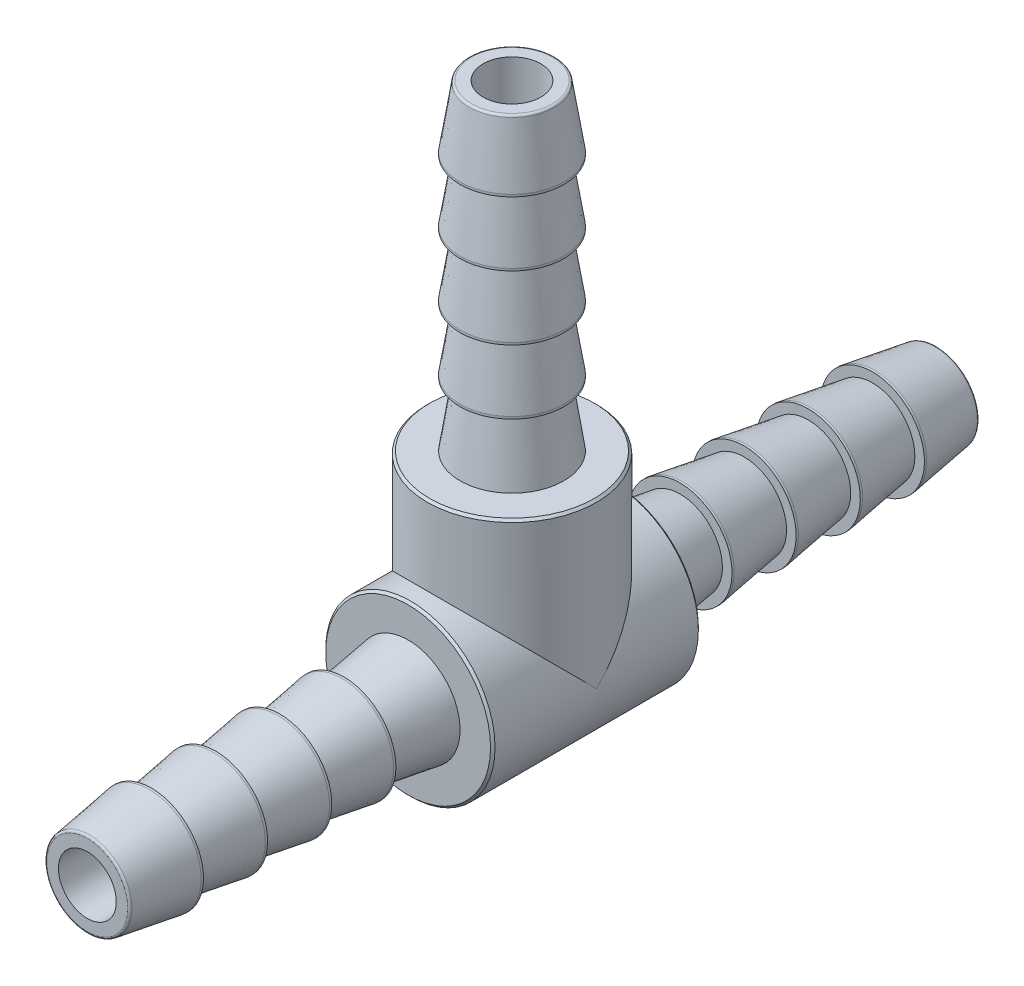
ISO-10303-21;
HEADER;
FILE_DESCRIPTION(('STEP AP214'),'2;1');
FILE_NAME('part.step','',(''),(''),'','','');
FILE_SCHEMA(('AUTOMOTIVE_DESIGN { 1 0 10303 214 1 1 1 1 }'));
ENDSEC;
DATA;
#1=APPLICATION_CONTEXT('core data for automotive mechanical design processes');
#2=APPLICATION_PROTOCOL_DEFINITION('international standard','automotive_design',2000,#1);
#3=PRODUCT_CONTEXT('',#1,'mechanical');
#4=PRODUCT('Part','Part','',(#3));
#5=PRODUCT_RELATED_PRODUCT_CATEGORY('part','',(#4));
#6=PRODUCT_DEFINITION_FORMATION('','',#4);
#7=PRODUCT_DEFINITION_CONTEXT('part definition',#1,'design');
#8=PRODUCT_DEFINITION('design','',#6,#7);
#9=PRODUCT_DEFINITION_SHAPE('','',#8);
#10=(LENGTH_UNIT() NAMED_UNIT(*) SI_UNIT(.MILLI.,.METRE.));
#11=(NAMED_UNIT(*) PLANE_ANGLE_UNIT() SI_UNIT($,.RADIAN.));
#12=(NAMED_UNIT(*) SI_UNIT($,.STERADIAN.) SOLID_ANGLE_UNIT());
#13=UNCERTAINTY_MEASURE_WITH_UNIT(LENGTH_MEASURE(1.E-05),#10,'distance_accuracy_value','');
#14=(GEOMETRIC_REPRESENTATION_CONTEXT(3) GLOBAL_UNCERTAINTY_ASSIGNED_CONTEXT((#13)) GLOBAL_UNIT_ASSIGNED_CONTEXT((#10,
#11,#12)) REPRESENTATION_CONTEXT('',''));
#15=CARTESIAN_POINT('',(0.,0.,0.));
#16=DIRECTION('',(0.,0.,1.));
#17=DIRECTION('',(1.,0.,0.));
#18=AXIS2_PLACEMENT_3D('',#15,#16,#17);
#19=CARTESIAN_POINT('',(0.,0.,23.876));
#20=DIRECTION('',(0.,0.,-1.));
#21=DIRECTION('',(-1.,0.,0.));
#22=AXIS2_PLACEMENT_3D('',#19,#20,#21);
#23=PLANE('',#22);
#24=CARTESIAN_POINT('',(0.,0.,23.876));
#25=DIRECTION('',(0.,0.,-1.));
#26=DIRECTION('',(-1.,0.,0.));
#27=AXIS2_PLACEMENT_3D('',#24,#25,#26);
#28=CIRCLE('',#27,2.27243024163016);
#29=CARTESIAN_POINT('',(-2.27243024163016,0.,23.876));
#30=VERTEX_POINT('',#29);
#31=EDGE_CURVE('E11',#30,#30,#28,.F.);
#32=ORIENTED_EDGE('',*,*,#31,.T.);
#33=EDGE_LOOP('',(#32));
#34=FACE_BOUND('',#33,.T.);
#35=CARTESIAN_POINT('',(0.,0.,23.876));
#36=DIRECTION('',(0.,0.,1.));
#37=DIRECTION('',(1.,0.,0.));
#38=AXIS2_PLACEMENT_3D('',#35,#36,#37);
#39=CIRCLE('',#38,1.6256);
#40=CARTESIAN_POINT('',(1.6256,0.,23.876));
#41=VERTEX_POINT('',#40);
#42=EDGE_CURVE('E260',#41,#41,#39,.T.);
#43=ORIENTED_EDGE('',*,*,#42,.F.);
#44=EDGE_LOOP('',(#43));
#45=FACE_BOUND('',#44,.T.);
#46=ADVANCED_FACE('F39',(#34,#45),#23,.F.);
#47=CARTESIAN_POINT('',(0.,0.,-23.876));
#48=DIRECTION('',(0.,0.,1.));
#49=DIRECTION('',(1.,0.,0.));
#50=AXIS2_PLACEMENT_3D('',#47,#48,#49);
#51=PLANE('',#50);
#52=CARTESIAN_POINT('',(0.,0.,-23.876));
#53=DIRECTION('',(0.,0.,1.));
#54=DIRECTION('',(1.,0.,0.));
#55=AXIS2_PLACEMENT_3D('',#52,#53,#54);
#56=CIRCLE('',#55,2.27243024163016);
#57=CARTESIAN_POINT('',(2.27243024163016,0.,-23.876));
#58=VERTEX_POINT('',#57);
#59=EDGE_CURVE('E103',#58,#58,#56,.F.);
#60=ORIENTED_EDGE('',*,*,#59,.T.);
#61=EDGE_LOOP('',(#60));
#62=FACE_BOUND('',#61,.T.);
#63=CARTESIAN_POINT('',(0.,0.,-23.876));
#64=DIRECTION('',(0.,0.,1.));
#65=DIRECTION('',(1.,0.,0.));
#66=AXIS2_PLACEMENT_3D('',#63,#64,#65);
#67=CIRCLE('',#66,1.6256);
#68=CARTESIAN_POINT('',(1.6256,0.,-23.876));
#69=VERTEX_POINT('',#68);
#70=EDGE_CURVE('E257',#69,#69,#67,.F.);
#71=ORIENTED_EDGE('',*,*,#70,.F.);
#72=EDGE_LOOP('',(#71));
#73=FACE_BOUND('',#72,.T.);
#74=ADVANCED_FACE('F121',(#62,#73),#51,.F.);
#75=CARTESIAN_POINT('',(0.,0.,0.));
#76=DIRECTION('',(0.,-1.,0.));
#77=DIRECTION('',(0.,0.,-1.));
#78=AXIS2_PLACEMENT_3D('',#75,#76,#77);
#79=CYLINDRICAL_SURFACE('',#78,4.7625);
#80=CARTESIAN_POINT('',(0.,9.08049999999999,0.));
#81=DIRECTION('',(0.,1.,0.));
#82=DIRECTION('',(0.,0.,1.));
#83=AXIS2_PLACEMENT_3D('',#80,#81,#82);
#84=CIRCLE('',#83,4.7625);
#85=CARTESIAN_POINT('',(0.,9.08049999999999,4.7625));
#86=VERTEX_POINT('',#85);
#87=EDGE_CURVE('E73',#86,#86,#84,.F.);
#88=ORIENTED_EDGE('',*,*,#87,.T.);
#89=EDGE_LOOP('',(#88));
#90=FACE_BOUND('',#89,.T.);
#91=CARTESIAN_POINT('',(0.,0.,0.));
#92=DIRECTION('',(0.,0.707106781186547,0.707106781186547));
#93=DIRECTION('',(0.,-0.707106781186547,0.707106781186547));
#94=AXIS2_PLACEMENT_3D('',#91,#92,#93);
#95=ELLIPSE('',#94,6.73519209080187,4.7625);
#96=CARTESIAN_POINT('',(4.7625,0.,0.));
#97=VERTEX_POINT('',#96);
#98=CARTESIAN_POINT('',(-4.7625,0.,0.));
#99=VERTEX_POINT('',#98);
#100=EDGE_CURVE('E60',#97,#99,#95,.T.);
#101=ORIENTED_EDGE('',*,*,#100,.T.);
#102=CARTESIAN_POINT('',(0.,0.,0.));
#103=DIRECTION('',(0.,-0.707106781186547,0.707106781186547));
#104=DIRECTION('',(0.,0.707106781186547,0.707106781186547));
#105=AXIS2_PLACEMENT_3D('',#102,#103,#104);
#106=ELLIPSE('',#105,6.73519209080187,4.7625);
#107=EDGE_CURVE('E69',#99,#97,#106,.F.);
#108=ORIENTED_EDGE('',*,*,#107,.T.);
#109=EDGE_LOOP('',(#101,#108));
#110=FACE_BOUND('',#109,.T.);
#111=ADVANCED_FACE('F128',(#90,#110),#79,.T.);
#112=CARTESIAN_POINT('',(0.,0.,23.876));
#113=DIRECTION('',(0.,0.,1.));
#114=DIRECTION('',(1.,0.,0.));
#115=AXIS2_PLACEMENT_3D('',#112,#113,#114);
#116=CYLINDRICAL_SURFACE('',#115,4.7625);
#117=CARTESIAN_POINT('',(0.,0.,-5.715));
#118=DIRECTION('',(0.,0.,-1.));
#119=DIRECTION('',(-1.,0.,0.));
#120=AXIS2_PLACEMENT_3D('',#117,#118,#119);
#121=CIRCLE('',#120,4.7625);
#122=CARTESIAN_POINT('',(-4.7625,0.,-5.715));
#123=VERTEX_POINT('',#122);
#124=EDGE_CURVE('E85',#123,#123,#121,.F.);
#125=ORIENTED_EDGE('',*,*,#124,.T.);
#126=EDGE_LOOP('',(#125));
#127=FACE_BOUND('',#126,.T.);
#128=CARTESIAN_POINT('',(0.,0.,5.715));
#129=DIRECTION('',(0.,0.,1.));
#130=DIRECTION('',(1.,0.,0.));
#131=AXIS2_PLACEMENT_3D('',#128,#129,#130);
#132=CIRCLE('',#131,4.7625);
#133=CARTESIAN_POINT('',(4.7625,0.,5.715));
#134=VERTEX_POINT('',#133);
#135=EDGE_CURVE('E82',#134,#134,#132,.F.);
#136=ORIENTED_EDGE('',*,*,#135,.T.);
#137=EDGE_LOOP('',(#136));
#138=FACE_BOUND('',#137,.T.);
#139=ORIENTED_EDGE('',*,*,#107,.F.);
#140=ORIENTED_EDGE('',*,*,#100,.F.);
#141=EDGE_LOOP('',(#139,#140));
#142=FACE_BOUND('',#141,.T.);
#143=ADVANCED_FACE('F133',(#127,#138,#142),#116,.T.);
#144=CARTESIAN_POINT('',(0.,0.,16.7894));
#145=DIRECTION('',(0.,0.,-1.));
#146=DIRECTION('',(0.,1.,0.));
#147=AXIS2_PLACEMENT_3D('',#144,#145,#146);
#148=CONICAL_SURFACE('',#147,2.921,0.153883218638279);
#149=CARTESIAN_POINT('',(0.,0.,20.2692));
#150=DIRECTION('',(0.,0.,-1.));
#151=DIRECTION('',(0.,1.,0.));
#152=AXIS2_PLACEMENT_3D('',#149,#150,#151);
#153=CIRCLE('',#152,2.38125);
#154=CARTESIAN_POINT('',(0.,2.38125,20.2692));
#155=VERTEX_POINT('',#154);
#156=EDGE_CURVE('E235',#155,#155,#153,.T.);
#157=ORIENTED_EDGE('',*,*,#156,.T.);
#158=EDGE_LOOP('',(#157));
#159=FACE_BOUND('',#158,.T.);
#160=CARTESIAN_POINT('',(0.,0.,16.7894));
#161=DIRECTION('',(0.,0.,-1.));
#162=DIRECTION('',(0.,1.,0.));
#163=AXIS2_PLACEMENT_3D('',#160,#161,#162);
#164=CIRCLE('',#163,2.921);
#165=CARTESIAN_POINT('',(0.,2.921,16.7894));
#166=VERTEX_POINT('',#165);
#167=EDGE_CURVE('E241',#166,#166,#164,.T.);
#168=ORIENTED_EDGE('',*,*,#167,.F.);
#169=EDGE_LOOP('',(#168));
#170=FACE_BOUND('',#169,.T.);
#171=ADVANCED_FACE('F426',(#159,#170),#148,.T.);
#172=CARTESIAN_POINT('',(0.,0.,2.2352));
#173=DIRECTION('',(0.,0.,-1.));
#174=DIRECTION('',(0.,1.,0.));
#175=AXIS2_PLACEMENT_3D('',#172,#173,#174);
#176=CYLINDRICAL_SURFACE('',#175,2.921);
#177=ORIENTED_EDGE('',*,*,#167,.T.);
#178=EDGE_LOOP('',(#177));
#179=FACE_BOUND('',#178,.T.);
#180=CARTESIAN_POINT('',(0.,0.,16.6624));
#181=DIRECTION('',(0.,0.,-1.));
#182=DIRECTION('',(0.,1.,0.));
#183=AXIS2_PLACEMENT_3D('',#180,#181,#182);
#184=CIRCLE('',#183,2.921);
#185=CARTESIAN_POINT('',(0.,2.921,16.6624));
#186=VERTEX_POINT('',#185);
#187=EDGE_CURVE('E238',#186,#186,#184,.T.);
#188=ORIENTED_EDGE('',*,*,#187,.F.);
#189=EDGE_LOOP('',(#188));
#190=FACE_BOUND('',#189,.T.);
#191=ADVANCED_FACE('F422',(#179,#190),#176,.T.);
#192=CARTESIAN_POINT('',(0.,2.38125,16.6624));
#193=DIRECTION('',(0.,0.,-1.));
#194=DIRECTION('',(0.,1.,0.));
#195=AXIS2_PLACEMENT_3D('',#192,#193,#194);
#196=PLANE('',#195);
#197=ORIENTED_EDGE('',*,*,#187,.T.);
#198=EDGE_LOOP('',(#197));
#199=FACE_BOUND('',#198,.T.);
#200=CARTESIAN_POINT('',(0.,0.,16.6624));
#201=DIRECTION('',(0.,0.,-1.));
#202=DIRECTION('',(0.,1.,0.));
#203=AXIS2_PLACEMENT_3D('',#200,#201,#202);
#204=CIRCLE('',#203,2.38125);
#205=CARTESIAN_POINT('',(0.,2.38125,16.6624));
#206=VERTEX_POINT('',#205);
#207=EDGE_CURVE('E226',#206,#206,#204,.T.);
#208=ORIENTED_EDGE('',*,*,#207,.F.);
#209=EDGE_LOOP('',(#208));
#210=FACE_BOUND('',#209,.T.);
#211=ADVANCED_FACE('F419',(#199,#210),#196,.T.);
#212=CARTESIAN_POINT('',(0.,0.,20.3962));
#213=DIRECTION('',(0.,0.,-1.));
#214=DIRECTION('',(0.,1.,0.));
#215=AXIS2_PLACEMENT_3D('',#212,#213,#214);
#216=CONICAL_SURFACE('',#215,2.921,0.153883218638279);
#217=CARTESIAN_POINT('',(0.,0.,23.7684661295191));
#218=DIRECTION('',(0.,0.,-1.));
#219=DIRECTION('',(0.,1.,0.));
#220=AXIS2_PLACEMENT_3D('',#217,#218,#219);
#221=CIRCLE('',#220,2.39792952370598);
#222=CARTESIAN_POINT('',(0.,2.39792952370598,23.7684661295191));
#223=VERTEX_POINT('',#222);
#224=EDGE_CURVE('E47',#223,#223,#221,.T.);
#225=ORIENTED_EDGE('',*,*,#224,.T.);
#226=EDGE_LOOP('',(#225));
#227=FACE_BOUND('',#226,.T.);
#228=CARTESIAN_POINT('',(0.,0.,20.3962));
#229=DIRECTION('',(0.,0.,-1.));
#230=DIRECTION('',(0.,1.,0.));
#231=AXIS2_PLACEMENT_3D('',#228,#229,#230);
#232=CIRCLE('',#231,2.921);
#233=CARTESIAN_POINT('',(0.,2.921,20.3962));
#234=VERTEX_POINT('',#233);
#235=EDGE_CURVE('E247',#234,#234,#232,.T.);
#236=ORIENTED_EDGE('',*,*,#235,.F.);
#237=EDGE_LOOP('',(#236));
#238=FACE_BOUND('',#237,.T.);
#239=ADVANCED_FACE('F108',(#227,#238),#216,.T.);
#240=CARTESIAN_POINT('',(0.,0.,5.842));
#241=DIRECTION('',(0.,0.,-1.));
#242=DIRECTION('',(0.,1.,0.));
#243=AXIS2_PLACEMENT_3D('',#240,#241,#242);
#244=CYLINDRICAL_SURFACE('',#243,2.921);
#245=ORIENTED_EDGE('',*,*,#235,.T.);
#246=EDGE_LOOP('',(#245));
#247=FACE_BOUND('',#246,.T.);
#248=CARTESIAN_POINT('',(0.,0.,20.2692));
#249=DIRECTION('',(0.,0.,-1.));
#250=DIRECTION('',(0.,1.,0.));
#251=AXIS2_PLACEMENT_3D('',#248,#249,#250);
#252=CIRCLE('',#251,2.921);
#253=CARTESIAN_POINT('',(0.,2.921,20.2692));
#254=VERTEX_POINT('',#253);
#255=EDGE_CURVE('E244',#254,#254,#252,.T.);
#256=ORIENTED_EDGE('',*,*,#255,.F.);
#257=EDGE_LOOP('',(#256));
#258=FACE_BOUND('',#257,.T.);
#259=ADVANCED_FACE('F433',(#247,#258),#244,.T.);
#260=CARTESIAN_POINT('',(0.,2.38125,20.2692));
#261=DIRECTION('',(0.,0.,-1.));
#262=DIRECTION('',(0.,1.,0.));
#263=AXIS2_PLACEMENT_3D('',#260,#261,#262);
#264=PLANE('',#263);
#265=ORIENTED_EDGE('',*,*,#255,.T.);
#266=EDGE_LOOP('',(#265));
#267=FACE_BOUND('',#266,.T.);
#268=ORIENTED_EDGE('',*,*,#156,.F.);
#269=EDGE_LOOP('',(#268));
#270=FACE_BOUND('',#269,.T.);
#271=ADVANCED_FACE('F417',(#267,#270),#264,.T.);
#272=CARTESIAN_POINT('',(0.,0.,13.1826));
#273=DIRECTION('',(0.,0.,-1.));
#274=DIRECTION('',(0.,1.,0.));
#275=AXIS2_PLACEMENT_3D('',#272,#273,#274);
#276=CONICAL_SURFACE('',#275,2.921,0.153883218638279);
#277=ORIENTED_EDGE('',*,*,#207,.T.);
#278=EDGE_LOOP('',(#277));
#279=FACE_BOUND('',#278,.T.);
#280=CARTESIAN_POINT('',(0.,0.,13.1826));
#281=DIRECTION('',(0.,0.,-1.));
#282=DIRECTION('',(0.,1.,0.));
#283=AXIS2_PLACEMENT_3D('',#280,#281,#282);
#284=CIRCLE('',#283,2.921);
#285=CARTESIAN_POINT('',(0.,2.921,13.1826));
#286=VERTEX_POINT('',#285);
#287=EDGE_CURVE('E232',#286,#286,#284,.T.);
#288=ORIENTED_EDGE('',*,*,#287,.F.);
#289=EDGE_LOOP('',(#288));
#290=FACE_BOUND('',#289,.T.);
#291=ADVANCED_FACE('F413',(#279,#290),#276,.T.);
#292=CARTESIAN_POINT('',(0.,0.,-1.3716));
#293=DIRECTION('',(0.,0.,-1.));
#294=DIRECTION('',(0.,1.,0.));
#295=AXIS2_PLACEMENT_3D('',#292,#293,#294);
#296=CYLINDRICAL_SURFACE('',#295,2.921);
#297=ORIENTED_EDGE('',*,*,#287,.T.);
#298=EDGE_LOOP('',(#297));
#299=FACE_BOUND('',#298,.T.);
#300=CARTESIAN_POINT('',(0.,0.,13.0556));
#301=DIRECTION('',(0.,0.,-1.));
#302=DIRECTION('',(0.,1.,0.));
#303=AXIS2_PLACEMENT_3D('',#300,#301,#302);
#304=CIRCLE('',#303,2.921);
#305=CARTESIAN_POINT('',(0.,2.921,13.0556));
#306=VERTEX_POINT('',#305);
#307=EDGE_CURVE('E229',#306,#306,#304,.T.);
#308=ORIENTED_EDGE('',*,*,#307,.F.);
#309=EDGE_LOOP('',(#308));
#310=FACE_BOUND('',#309,.T.);
#311=ADVANCED_FACE('F409',(#299,#310),#296,.T.);
#312=CARTESIAN_POINT('',(0.,2.38125,13.0556));
#313=DIRECTION('',(0.,0.,-1.));
#314=DIRECTION('',(0.,1.,0.));
#315=AXIS2_PLACEMENT_3D('',#312,#313,#314);
#316=PLANE('',#315);
#317=ORIENTED_EDGE('',*,*,#307,.T.);
#318=EDGE_LOOP('',(#317));
#319=FACE_BOUND('',#318,.T.);
#320=CARTESIAN_POINT('',(0.,0.,13.0556));
#321=DIRECTION('',(0.,0.,-1.));
#322=DIRECTION('',(0.,1.,0.));
#323=AXIS2_PLACEMENT_3D('',#320,#321,#322);
#324=CIRCLE('',#323,2.38125);
#325=CARTESIAN_POINT('',(0.,2.38125,13.0556));
#326=VERTEX_POINT('',#325);
#327=EDGE_CURVE('E217',#326,#326,#324,.T.);
#328=ORIENTED_EDGE('',*,*,#327,.F.);
#329=EDGE_LOOP('',(#328));
#330=FACE_BOUND('',#329,.T.);
#331=ADVANCED_FACE('F405',(#319,#330),#316,.T.);
#332=CARTESIAN_POINT('',(0.,0.,9.5758));
#333=DIRECTION('',(0.,0.,-1.));
#334=DIRECTION('',(0.,1.,0.));
#335=AXIS2_PLACEMENT_3D('',#332,#333,#334);
#336=CONICAL_SURFACE('',#335,2.921,0.153883218638279);
#337=ORIENTED_EDGE('',*,*,#327,.T.);
#338=EDGE_LOOP('',(#337));
#339=FACE_BOUND('',#338,.T.);
#340=CARTESIAN_POINT('',(0.,0.,9.5758));
#341=DIRECTION('',(0.,0.,-1.));
#342=DIRECTION('',(0.,1.,0.));
#343=AXIS2_PLACEMENT_3D('',#340,#341,#342);
#344=CIRCLE('',#343,2.921);
#345=CARTESIAN_POINT('',(0.,2.921,9.5758));
#346=VERTEX_POINT('',#345);
#347=EDGE_CURVE('E223',#346,#346,#344,.T.);
#348=ORIENTED_EDGE('',*,*,#347,.F.);
#349=EDGE_LOOP('',(#348));
#350=FACE_BOUND('',#349,.T.);
#351=ADVANCED_FACE('F401',(#339,#350),#336,.T.);
#352=CARTESIAN_POINT('',(0.,0.,-4.9784));
#353=DIRECTION('',(0.,0.,-1.));
#354=DIRECTION('',(0.,1.,0.));
#355=AXIS2_PLACEMENT_3D('',#352,#353,#354);
#356=CYLINDRICAL_SURFACE('',#355,2.921);
#357=ORIENTED_EDGE('',*,*,#347,.T.);
#358=EDGE_LOOP('',(#357));
#359=FACE_BOUND('',#358,.T.);
#360=CARTESIAN_POINT('',(0.,0.,9.4488));
#361=DIRECTION('',(0.,0.,-1.));
#362=DIRECTION('',(0.,1.,0.));
#363=AXIS2_PLACEMENT_3D('',#360,#361,#362);
#364=CIRCLE('',#363,2.921);
#365=CARTESIAN_POINT('',(0.,2.921,9.4488));
#366=VERTEX_POINT('',#365);
#367=EDGE_CURVE('E220',#366,#366,#364,.T.);
#368=ORIENTED_EDGE('',*,*,#367,.F.);
#369=EDGE_LOOP('',(#368));
#370=FACE_BOUND('',#369,.T.);
#371=ADVANCED_FACE('F397',(#359,#370),#356,.T.);
#372=CARTESIAN_POINT('',(0.,2.38125,9.4488));
#373=DIRECTION('',(0.,0.,-1.));
#374=DIRECTION('',(0.,1.,0.));
#375=AXIS2_PLACEMENT_3D('',#372,#373,#374);
#376=PLANE('',#375);
#377=ORIENTED_EDGE('',*,*,#367,.T.);
#378=EDGE_LOOP('',(#377));
#379=FACE_BOUND('',#378,.T.);
#380=CARTESIAN_POINT('',(0.,0.,9.4488));
#381=DIRECTION('',(0.,0.,1.));
#382=DIRECTION('',(1.,0.,0.));
#383=AXIS2_PLACEMENT_3D('',#380,#381,#382);
#384=CIRCLE('',#383,2.38125);
#385=CARTESIAN_POINT('',(2.38125,0.,9.4488));
#386=VERTEX_POINT('',#385);
#387=EDGE_CURVE('E253',#386,#386,#384,.T.);
#388=ORIENTED_EDGE('',*,*,#387,.T.);
#389=EDGE_LOOP('',(#388));
#390=FACE_BOUND('',#389,.T.);
#391=ADVANCED_FACE('F393',(#379,#390),#376,.T.);
#392=CARTESIAN_POINT('',(0.,2.921,5.842));
#393=DIRECTION('',(0.,0.,1.));
#394=DIRECTION('',(1.,0.,0.));
#395=AXIS2_PLACEMENT_3D('',#392,#393,#394);
#396=PLANE('',#395);
#397=CARTESIAN_POINT('',(0.,0.,5.842));
#398=DIRECTION('',(0.,0.,1.));
#399=DIRECTION('',(1.,0.,0.));
#400=AXIS2_PLACEMENT_3D('',#397,#398,#399);
#401=CIRCLE('',#400,4.6355);
#402=CARTESIAN_POINT('',(4.6355,0.,5.842));
#403=VERTEX_POINT('',#402);
#404=EDGE_CURVE('E91',#403,#403,#401,.T.);
#405=ORIENTED_EDGE('',*,*,#404,.T.);
#406=EDGE_LOOP('',(#405));
#407=FACE_BOUND('',#406,.T.);
#408=CARTESIAN_POINT('',(0.,0.,5.842));
#409=DIRECTION('',(0.,0.,1.));
#410=DIRECTION('',(1.,0.,0.));
#411=AXIS2_PLACEMENT_3D('',#408,#409,#410);
#412=CIRCLE('',#411,2.921);
#413=CARTESIAN_POINT('',(2.921,0.,5.842));
#414=VERTEX_POINT('',#413);
#415=EDGE_CURVE('E250',#414,#414,#412,.T.);
#416=ORIENTED_EDGE('',*,*,#415,.F.);
#417=EDGE_LOOP('',(#416));
#418=FACE_BOUND('',#417,.T.);
#419=ADVANCED_FACE('F396',(#407,#418),#396,.T.);
#420=CARTESIAN_POINT('',(0.,0.,9.4488));
#421=DIRECTION('',(0.,0.,-1.));
#422=DIRECTION('',(-1.,0.,0.));
#423=AXIS2_PLACEMENT_3D('',#420,#421,#422);
#424=CONICAL_SURFACE('',#423,2.38125,0.148545565358798);
#425=ORIENTED_EDGE('',*,*,#415,.T.);
#426=EDGE_LOOP('',(#425));
#427=FACE_BOUND('',#426,.T.);
#428=ORIENTED_EDGE('',*,*,#387,.F.);
#429=EDGE_LOOP('',(#428));
#430=FACE_BOUND('',#429,.T.);
#431=ADVANCED_FACE('F391',(#427,#430),#424,.T.);
#432=CARTESIAN_POINT('',(0.,0.,-9.4488));
#433=DIRECTION('',(0.,0.,1.));
#434=DIRECTION('',(-1.,0.,0.));
#435=AXIS2_PLACEMENT_3D('',#432,#433,#434);
#436=CONICAL_SURFACE('',#435,2.38125,0.148545565358798);
#437=CARTESIAN_POINT('',(0.,0.,-5.842));
#438=DIRECTION('',(0.,0.,1.));
#439=DIRECTION('',(1.,0.,0.));
#440=AXIS2_PLACEMENT_3D('',#437,#438,#439);
#441=CIRCLE('',#440,2.921);
#442=CARTESIAN_POINT('',(2.921,0.,-5.842));
#443=VERTEX_POINT('',#442);
#444=EDGE_CURVE('E214',#443,#443,#441,.T.);
#445=ORIENTED_EDGE('',*,*,#444,.F.);
#446=EDGE_LOOP('',(#445));
#447=FACE_BOUND('',#446,.T.);
#448=CARTESIAN_POINT('',(0.,0.,-9.4488));
#449=DIRECTION('',(0.,0.,-1.));
#450=DIRECTION('',(0.,1.,0.));
#451=AXIS2_PLACEMENT_3D('',#448,#449,#450);
#452=CIRCLE('',#451,2.38125);
#453=CARTESIAN_POINT('',(0.,2.38125,-9.4488));
#454=VERTEX_POINT('',#453);
#455=EDGE_CURVE('E181',#454,#454,#452,.T.);
#456=ORIENTED_EDGE('',*,*,#455,.F.);
#457=EDGE_LOOP('',(#456));
#458=FACE_BOUND('',#457,.T.);
#459=ADVANCED_FACE('F387',(#447,#458),#436,.T.);
#460=CARTESIAN_POINT('',(0.,2.921,-5.842));
#461=DIRECTION('',(0.,0.,-1.));
#462=DIRECTION('',(1.,0.,0.));
#463=AXIS2_PLACEMENT_3D('',#460,#461,#462);
#464=PLANE('',#463);
#465=CARTESIAN_POINT('',(0.,0.,-5.842));
#466=DIRECTION('',(0.,0.,-1.));
#467=DIRECTION('',(-1.,0.,0.));
#468=AXIS2_PLACEMENT_3D('',#465,#466,#467);
#469=CIRCLE('',#468,4.63550000000001);
#470=CARTESIAN_POINT('',(-4.63550000000001,0.,-5.842));
#471=VERTEX_POINT('',#470);
#472=EDGE_CURVE('E88',#471,#471,#469,.T.);
#473=ORIENTED_EDGE('',*,*,#472,.T.);
#474=EDGE_LOOP('',(#473));
#475=FACE_BOUND('',#474,.T.);
#476=ORIENTED_EDGE('',*,*,#444,.T.);
#477=EDGE_LOOP('',(#476));
#478=FACE_BOUND('',#477,.T.);
#479=ADVANCED_FACE('F349',(#475,#478),#464,.T.);
#480=CARTESIAN_POINT('',(0.,0.,-9.5758));
#481=DIRECTION('',(0.,0.,1.));
#482=DIRECTION('',(0.,1.,0.));
#483=AXIS2_PLACEMENT_3D('',#480,#481,#482);
#484=CONICAL_SURFACE('',#483,2.921,0.153883218638279);
#485=CARTESIAN_POINT('',(0.,0.,-13.0556));
#486=DIRECTION('',(0.,0.,-1.));
#487=DIRECTION('',(0.,1.,0.));
#488=AXIS2_PLACEMENT_3D('',#485,#486,#487);
#489=CIRCLE('',#488,2.38125);
#490=CARTESIAN_POINT('',(0.,2.38125,-13.0556));
#491=VERTEX_POINT('',#490);
#492=EDGE_CURVE('E178',#491,#491,#489,.T.);
#493=ORIENTED_EDGE('',*,*,#492,.F.);
#494=EDGE_LOOP('',(#493));
#495=FACE_BOUND('',#494,.T.);
#496=CARTESIAN_POINT('',(0.,0.,-9.5758));
#497=DIRECTION('',(0.,0.,-1.));
#498=DIRECTION('',(0.,1.,0.));
#499=AXIS2_PLACEMENT_3D('',#496,#497,#498);
#500=CIRCLE('',#499,2.921);
#501=CARTESIAN_POINT('',(0.,2.921,-9.5758));
#502=VERTEX_POINT('',#501);
#503=EDGE_CURVE('E187',#502,#502,#500,.T.);
#504=ORIENTED_EDGE('',*,*,#503,.T.);
#505=EDGE_LOOP('',(#504));
#506=FACE_BOUND('',#505,.T.);
#507=ADVANCED_FACE('F345',(#495,#506),#484,.T.);
#508=CARTESIAN_POINT('',(0.,0.,4.9784));
#509=DIRECTION('',(0.,0.,1.));
#510=DIRECTION('',(0.,1.,0.));
#511=AXIS2_PLACEMENT_3D('',#508,#509,#510);
#512=CYLINDRICAL_SURFACE('',#511,2.921);
#513=ORIENTED_EDGE('',*,*,#503,.F.);
#514=EDGE_LOOP('',(#513));
#515=FACE_BOUND('',#514,.T.);
#516=CARTESIAN_POINT('',(0.,0.,-9.4488));
#517=DIRECTION('',(0.,0.,-1.));
#518=DIRECTION('',(0.,1.,0.));
#519=AXIS2_PLACEMENT_3D('',#516,#517,#518);
#520=CIRCLE('',#519,2.921);
#521=CARTESIAN_POINT('',(0.,2.921,-9.4488));
#522=VERTEX_POINT('',#521);
#523=EDGE_CURVE('E184',#522,#522,#520,.T.);
#524=ORIENTED_EDGE('',*,*,#523,.T.);
#525=EDGE_LOOP('',(#524));
#526=FACE_BOUND('',#525,.T.);
#527=ADVANCED_FACE('F341',(#515,#526),#512,.T.);
#528=CARTESIAN_POINT('',(0.,2.38125,-9.4488));
#529=DIRECTION('',(0.,0.,1.));
#530=DIRECTION('',(0.,1.,0.));
#531=AXIS2_PLACEMENT_3D('',#528,#529,#530);
#532=PLANE('',#531);
#533=ORIENTED_EDGE('',*,*,#523,.F.);
#534=EDGE_LOOP('',(#533));
#535=FACE_BOUND('',#534,.T.);
#536=ORIENTED_EDGE('',*,*,#455,.T.);
#537=EDGE_LOOP('',(#536));
#538=FACE_BOUND('',#537,.T.);
#539=ADVANCED_FACE('F337',(#535,#538),#532,.T.);
#540=CARTESIAN_POINT('',(0.,0.,-20.3962));
#541=DIRECTION('',(0.,0.,1.));
#542=DIRECTION('',(0.,1.,0.));
#543=AXIS2_PLACEMENT_3D('',#540,#541,#542);
#544=CONICAL_SURFACE('',#543,2.921,0.153883218638279);
#545=CARTESIAN_POINT('',(0.,0.,-23.7684661295191));
#546=DIRECTION('',(0.,0.,1.));
#547=DIRECTION('',(0.,-1.,0.));
#548=AXIS2_PLACEMENT_3D('',#545,#546,#547);
#549=CIRCLE('',#548,2.39792952370598);
#550=CARTESIAN_POINT('',(0.,-2.39792952370598,-23.7684661295191));
#551=VERTEX_POINT('',#550);
#552=EDGE_CURVE('E100',#551,#551,#549,.T.);
#553=ORIENTED_EDGE('',*,*,#552,.T.);
#554=EDGE_LOOP('',(#553));
#555=FACE_BOUND('',#554,.T.);
#556=CARTESIAN_POINT('',(0.,0.,-20.3962));
#557=DIRECTION('',(0.,0.,-1.));
#558=DIRECTION('',(0.,1.,0.));
#559=AXIS2_PLACEMENT_3D('',#556,#557,#558);
#560=CIRCLE('',#559,2.921);
#561=CARTESIAN_POINT('',(0.,2.921,-20.3962));
#562=VERTEX_POINT('',#561);
#563=EDGE_CURVE('E211',#562,#562,#560,.T.);
#564=ORIENTED_EDGE('',*,*,#563,.T.);
#565=EDGE_LOOP('',(#564));
#566=FACE_BOUND('',#565,.T.);
#567=ADVANCED_FACE('F340',(#555,#566),#544,.T.);
#568=CARTESIAN_POINT('',(0.,0.,-5.842));
#569=DIRECTION('',(0.,0.,1.));
#570=DIRECTION('',(0.,1.,0.));
#571=AXIS2_PLACEMENT_3D('',#568,#569,#570);
#572=CYLINDRICAL_SURFACE('',#571,2.921);
#573=ORIENTED_EDGE('',*,*,#563,.F.);
#574=EDGE_LOOP('',(#573));
#575=FACE_BOUND('',#574,.T.);
#576=CARTESIAN_POINT('',(0.,0.,-20.2692));
#577=DIRECTION('',(0.,0.,-1.));
#578=DIRECTION('',(0.,1.,0.));
#579=AXIS2_PLACEMENT_3D('',#576,#577,#578);
#580=CIRCLE('',#579,2.921);
#581=CARTESIAN_POINT('',(0.,2.921,-20.2692));
#582=VERTEX_POINT('',#581);
#583=EDGE_CURVE('E208',#582,#582,#580,.T.);
#584=ORIENTED_EDGE('',*,*,#583,.T.);
#585=EDGE_LOOP('',(#584));
#586=FACE_BOUND('',#585,.T.);
#587=ADVANCED_FACE('F377',(#575,#586),#572,.T.);
#588=CARTESIAN_POINT('',(0.,2.38125,-20.2692));
#589=DIRECTION('',(0.,0.,1.));
#590=DIRECTION('',(0.,1.,0.));
#591=AXIS2_PLACEMENT_3D('',#588,#589,#590);
#592=PLANE('',#591);
#593=ORIENTED_EDGE('',*,*,#583,.F.);
#594=EDGE_LOOP('',(#593));
#595=FACE_BOUND('',#594,.T.);
#596=CARTESIAN_POINT('',(0.,0.,-20.2692));
#597=DIRECTION('',(0.,0.,-1.));
#598=DIRECTION('',(0.,1.,0.));
#599=AXIS2_PLACEMENT_3D('',#596,#597,#598);
#600=CIRCLE('',#599,2.38125);
#601=CARTESIAN_POINT('',(0.,2.38125,-20.2692));
#602=VERTEX_POINT('',#601);
#603=EDGE_CURVE('E199',#602,#602,#600,.T.);
#604=ORIENTED_EDGE('',*,*,#603,.T.);
#605=EDGE_LOOP('',(#604));
#606=FACE_BOUND('',#605,.T.);
#607=ADVANCED_FACE('F373',(#595,#606),#592,.T.);
#608=CARTESIAN_POINT('',(0.,0.,-16.7894));
#609=DIRECTION('',(0.,0.,1.));
#610=DIRECTION('',(0.,1.,0.));
#611=AXIS2_PLACEMENT_3D('',#608,#609,#610);
#612=CONICAL_SURFACE('',#611,2.921,0.153883218638279);
#613=ORIENTED_EDGE('',*,*,#603,.F.);
#614=EDGE_LOOP('',(#613));
#615=FACE_BOUND('',#614,.T.);
#616=CARTESIAN_POINT('',(0.,0.,-16.7894));
#617=DIRECTION('',(0.,0.,-1.));
#618=DIRECTION('',(0.,1.,0.));
#619=AXIS2_PLACEMENT_3D('',#616,#617,#618);
#620=CIRCLE('',#619,2.921);
#621=CARTESIAN_POINT('',(0.,2.921,-16.7894));
#622=VERTEX_POINT('',#621);
#623=EDGE_CURVE('E205',#622,#622,#620,.T.);
#624=ORIENTED_EDGE('',*,*,#623,.T.);
#625=EDGE_LOOP('',(#624));
#626=FACE_BOUND('',#625,.T.);
#627=ADVANCED_FACE('F369',(#615,#626),#612,.T.);
#628=CARTESIAN_POINT('',(0.,0.,-2.2352));
#629=DIRECTION('',(0.,0.,1.));
#630=DIRECTION('',(0.,1.,0.));
#631=AXIS2_PLACEMENT_3D('',#628,#629,#630);
#632=CYLINDRICAL_SURFACE('',#631,2.921);
#633=ORIENTED_EDGE('',*,*,#623,.F.);
#634=EDGE_LOOP('',(#633));
#635=FACE_BOUND('',#634,.T.);
#636=CARTESIAN_POINT('',(0.,0.,-16.6624));
#637=DIRECTION('',(0.,0.,-1.));
#638=DIRECTION('',(0.,1.,0.));
#639=AXIS2_PLACEMENT_3D('',#636,#637,#638);
#640=CIRCLE('',#639,2.921);
#641=CARTESIAN_POINT('',(0.,2.921,-16.6624));
#642=VERTEX_POINT('',#641);
#643=EDGE_CURVE('E202',#642,#642,#640,.T.);
#644=ORIENTED_EDGE('',*,*,#643,.T.);
#645=EDGE_LOOP('',(#644));
#646=FACE_BOUND('',#645,.T.);
#647=ADVANCED_FACE('F365',(#635,#646),#632,.T.);
#648=CARTESIAN_POINT('',(0.,2.38125,-16.6624));
#649=DIRECTION('',(0.,0.,1.));
#650=DIRECTION('',(0.,1.,0.));
#651=AXIS2_PLACEMENT_3D('',#648,#649,#650);
#652=PLANE('',#651);
#653=ORIENTED_EDGE('',*,*,#643,.F.);
#654=EDGE_LOOP('',(#653));
#655=FACE_BOUND('',#654,.T.);
#656=CARTESIAN_POINT('',(0.,0.,-16.6624));
#657=DIRECTION('',(0.,0.,-1.));
#658=DIRECTION('',(0.,1.,0.));
#659=AXIS2_PLACEMENT_3D('',#656,#657,#658);
#660=CIRCLE('',#659,2.38125);
#661=CARTESIAN_POINT('',(0.,2.38125,-16.6624));
#662=VERTEX_POINT('',#661);
#663=EDGE_CURVE('E190',#662,#662,#660,.T.);
#664=ORIENTED_EDGE('',*,*,#663,.T.);
#665=EDGE_LOOP('',(#664));
#666=FACE_BOUND('',#665,.T.);
#667=ADVANCED_FACE('F361',(#655,#666),#652,.T.);
#668=CARTESIAN_POINT('',(0.,0.,-13.1826));
#669=DIRECTION('',(0.,0.,1.));
#670=DIRECTION('',(0.,1.,0.));
#671=AXIS2_PLACEMENT_3D('',#668,#669,#670);
#672=CONICAL_SURFACE('',#671,2.921,0.153883218638279);
#673=ORIENTED_EDGE('',*,*,#663,.F.);
#674=EDGE_LOOP('',(#673));
#675=FACE_BOUND('',#674,.T.);
#676=CARTESIAN_POINT('',(0.,0.,-13.1826));
#677=DIRECTION('',(0.,0.,-1.));
#678=DIRECTION('',(0.,1.,0.));
#679=AXIS2_PLACEMENT_3D('',#676,#677,#678);
#680=CIRCLE('',#679,2.921);
#681=CARTESIAN_POINT('',(0.,2.921,-13.1826));
#682=VERTEX_POINT('',#681);
#683=EDGE_CURVE('E196',#682,#682,#680,.T.);
#684=ORIENTED_EDGE('',*,*,#683,.T.);
#685=EDGE_LOOP('',(#684));
#686=FACE_BOUND('',#685,.T.);
#687=ADVANCED_FACE('F357',(#675,#686),#672,.T.);
#688=CARTESIAN_POINT('',(0.,0.,1.3716));
#689=DIRECTION('',(0.,0.,1.));
#690=DIRECTION('',(0.,1.,0.));
#691=AXIS2_PLACEMENT_3D('',#688,#689,#690);
#692=CYLINDRICAL_SURFACE('',#691,2.921);
#693=ORIENTED_EDGE('',*,*,#683,.F.);
#694=EDGE_LOOP('',(#693));
#695=FACE_BOUND('',#694,.T.);
#696=CARTESIAN_POINT('',(0.,0.,-13.0556));
#697=DIRECTION('',(0.,0.,-1.));
#698=DIRECTION('',(0.,1.,0.));
#699=AXIS2_PLACEMENT_3D('',#696,#697,#698);
#700=CIRCLE('',#699,2.921);
#701=CARTESIAN_POINT('',(0.,2.921,-13.0556));
#702=VERTEX_POINT('',#701);
#703=EDGE_CURVE('E193',#702,#702,#700,.T.);
#704=ORIENTED_EDGE('',*,*,#703,.T.);
#705=EDGE_LOOP('',(#704));
#706=FACE_BOUND('',#705,.T.);
#707=ADVANCED_FACE('F353',(#695,#706),#692,.T.);
#708=CARTESIAN_POINT('',(0.,2.38125,-13.0556));
#709=DIRECTION('',(0.,0.,1.));
#710=DIRECTION('',(0.,1.,0.));
#711=AXIS2_PLACEMENT_3D('',#708,#709,#710);
#712=PLANE('',#711);
#713=ORIENTED_EDGE('',*,*,#703,.F.);
#714=EDGE_LOOP('',(#713));
#715=FACE_BOUND('',#714,.T.);
#716=ORIENTED_EDGE('',*,*,#492,.T.);
#717=EDGE_LOOP('',(#716));
#718=FACE_BOUND('',#717,.T.);
#719=ADVANCED_FACE('F328',(#715,#718),#712,.T.);
#720=CARTESIAN_POINT('',(0.,9.2075,0.));
#721=DIRECTION('',(0.,-1.,0.));
#722=DIRECTION('',(0.,0.,-1.));
#723=AXIS2_PLACEMENT_3D('',#720,#721,#722);
#724=CONICAL_SURFACE('',#723,2.921,0.148545565358799);
#725=CARTESIAN_POINT('',(0.,12.8143,0.));
#726=DIRECTION('',(0.,1.,0.));
#727=DIRECTION('',(0.,0.,1.));
#728=AXIS2_PLACEMENT_3D('',#725,#726,#727);
#729=CIRCLE('',#728,2.38125);
#730=CARTESIAN_POINT('',(0.,12.8143,2.38125));
#731=VERTEX_POINT('',#730);
#732=EDGE_CURVE('E278',#731,#731,#729,.T.);
#733=ORIENTED_EDGE('',*,*,#732,.F.);
#734=EDGE_LOOP('',(#733));
#735=FACE_BOUND('',#734,.T.);
#736=CARTESIAN_POINT('',(0.,9.2075,0.));
#737=DIRECTION('',(0.,-1.,0.));
#738=DIRECTION('',(0.,0.,-1.));
#739=AXIS2_PLACEMENT_3D('',#736,#737,#738);
#740=CIRCLE('',#739,2.921);
#741=CARTESIAN_POINT('',(0.,9.2075,-2.921));
#742=VERTEX_POINT('',#741);
#743=EDGE_CURVE('E169',#742,#742,#740,.T.);
#744=ORIENTED_EDGE('',*,*,#743,.F.);
#745=EDGE_LOOP('',(#744));
#746=FACE_BOUND('',#745,.T.);
#747=ADVANCED_FACE('F324',(#735,#746),#724,.T.);
#748=CARTESIAN_POINT('',(0.,9.2075,2.921));
#749=DIRECTION('',(0.,1.,0.));
#750=DIRECTION('',(0.,0.,1.));
#751=AXIS2_PLACEMENT_3D('',#748,#749,#750);
#752=PLANE('',#751);
#753=CARTESIAN_POINT('',(0.,9.2075,0.));
#754=DIRECTION('',(0.,1.,0.));
#755=DIRECTION('',(0.,0.,1.));
#756=AXIS2_PLACEMENT_3D('',#753,#754,#755);
#757=CIRCLE('',#756,4.63549999999999);
#758=CARTESIAN_POINT('',(0.,9.2075,4.63549999999999));
#759=VERTEX_POINT('',#758);
#760=EDGE_CURVE('E76',#759,#759,#757,.T.);
#761=ORIENTED_EDGE('',*,*,#760,.T.);
#762=EDGE_LOOP('',(#761));
#763=FACE_BOUND('',#762,.T.);
#764=ORIENTED_EDGE('',*,*,#743,.T.);
#765=EDGE_LOOP('',(#764));
#766=FACE_BOUND('',#765,.T.);
#767=ADVANCED_FACE('F320',(#763,#766),#752,.T.);
#768=CARTESIAN_POINT('',(0.,12.8143,2.921));
#769=DIRECTION('',(0.,-1.,0.));
#770=DIRECTION('',(0.,0.,-1.));
#771=AXIS2_PLACEMENT_3D('',#768,#769,#770);
#772=PLANE('',#771);
#773=ORIENTED_EDGE('',*,*,#732,.T.);
#774=EDGE_LOOP('',(#773));
#775=FACE_BOUND('',#774,.T.);
#776=CARTESIAN_POINT('',(0.,12.8143,0.));
#777=DIRECTION('',(0.,1.,0.));
#778=DIRECTION('',(0.,0.,1.));
#779=AXIS2_PLACEMENT_3D('',#776,#777,#778);
#780=CIRCLE('',#779,2.921);
#781=CARTESIAN_POINT('',(0.,12.8143,2.921));
#782=VERTEX_POINT('',#781);
#783=EDGE_CURVE('E275',#782,#782,#780,.T.);
#784=ORIENTED_EDGE('',*,*,#783,.F.);
#785=EDGE_LOOP('',(#784));
#786=FACE_BOUND('',#785,.T.);
#787=ADVANCED_FACE('F323',(#775,#786),#772,.T.);
#788=CARTESIAN_POINT('',(0.,16.4211,0.));
#789=DIRECTION('',(0.,1.,0.));
#790=DIRECTION('',(0.,0.,1.));
#791=AXIS2_PLACEMENT_3D('',#788,#789,#790);
#792=CYLINDRICAL_SURFACE('',#791,2.921);
#793=ORIENTED_EDGE('',*,*,#783,.T.);
#794=EDGE_LOOP('',(#793));
#795=FACE_BOUND('',#794,.T.);
#796=CARTESIAN_POINT('',(0.,12.9413,0.));
#797=DIRECTION('',(0.,1.,0.));
#798=DIRECTION('',(0.,0.,1.));
#799=AXIS2_PLACEMENT_3D('',#796,#797,#798);
#800=CIRCLE('',#799,2.921);
#801=CARTESIAN_POINT('',(0.,12.9413,2.921));
#802=VERTEX_POINT('',#801);
#803=EDGE_CURVE('E264',#802,#802,#800,.T.);
#804=ORIENTED_EDGE('',*,*,#803,.F.);
#805=EDGE_LOOP('',(#804));
#806=FACE_BOUND('',#805,.T.);
#807=ADVANCED_FACE('F569',(#795,#806),#792,.T.);
#808=CARTESIAN_POINT('',(0.,16.4211,0.));
#809=DIRECTION('',(0.,-1.,0.));
#810=DIRECTION('',(0.,0.,-1.));
#811=AXIS2_PLACEMENT_3D('',#808,#809,#810);
#812=CONICAL_SURFACE('',#811,2.38125,0.153883218638279);
#813=ORIENTED_EDGE('',*,*,#803,.T.);
#814=EDGE_LOOP('',(#813));
#815=FACE_BOUND('',#814,.T.);
#816=CARTESIAN_POINT('',(0.,16.4211,0.));
#817=DIRECTION('',(0.,1.,0.));
#818=DIRECTION('',(0.,0.,1.));
#819=AXIS2_PLACEMENT_3D('',#816,#817,#818);
#820=CIRCLE('',#819,2.38125);
#821=CARTESIAN_POINT('',(0.,16.4211,2.38125));
#822=VERTEX_POINT('',#821);
#823=EDGE_CURVE('E259',#822,#822,#820,.T.);
#824=ORIENTED_EDGE('',*,*,#823,.F.);
#825=EDGE_LOOP('',(#824));
#826=FACE_BOUND('',#825,.T.);
#827=ADVANCED_FACE('F335',(#815,#826),#812,.T.);
#828=CARTESIAN_POINT('',(0.,27.2415,0.));
#829=DIRECTION('',(0.,-1.,0.));
#830=DIRECTION('',(0.,0.,-1.));
#831=AXIS2_PLACEMENT_3D('',#828,#829,#830);
#832=PLANE('',#831);
#833=CARTESIAN_POINT('',(0.,27.2415,0.));
#834=DIRECTION('',(0.,-1.,0.));
#835=DIRECTION('',(0.,0.,-1.));
#836=AXIS2_PLACEMENT_3D('',#833,#834,#835);
#837=CIRCLE('',#836,2.27243024163016);
#838=CARTESIAN_POINT('',(0.,27.2415,-2.27243024163016));
#839=VERTEX_POINT('',#838);
#840=EDGE_CURVE('E97',#839,#839,#837,.F.);
#841=ORIENTED_EDGE('',*,*,#840,.T.);
#842=EDGE_LOOP('',(#841));
#843=FACE_BOUND('',#842,.T.);
#844=CARTESIAN_POINT('',(0.,27.2415,0.));
#845=DIRECTION('',(0.,1.,0.));
#846=DIRECTION('',(0.,0.,1.));
#847=AXIS2_PLACEMENT_3D('',#844,#845,#846);
#848=CIRCLE('',#847,1.6256);
#849=CARTESIAN_POINT('',(0.,27.2415,1.6256));
#850=VERTEX_POINT('',#849);
#851=EDGE_CURVE('E267',#850,#850,#848,.T.);
#852=ORIENTED_EDGE('',*,*,#851,.F.);
#853=EDGE_LOOP('',(#852));
#854=FACE_BOUND('',#853,.T.);
#855=ADVANCED_FACE('F159',(#843,#854),#832,.F.);
#856=CARTESIAN_POINT('',(0.,27.2415,0.));
#857=DIRECTION('',(0.,-1.,0.));
#858=DIRECTION('',(0.,0.,-1.));
#859=AXIS2_PLACEMENT_3D('',#856,#857,#858);
#860=CONICAL_SURFACE('',#859,2.38125,0.153883218638279);
#861=CARTESIAN_POINT('',(0.,27.1339661295191,0.));
#862=DIRECTION('',(0.,-1.,0.));
#863=DIRECTION('',(0.,0.,-1.));
#864=AXIS2_PLACEMENT_3D('',#861,#862,#863);
#865=CIRCLE('',#864,2.39792952370598);
#866=CARTESIAN_POINT('',(0.,27.1339661295191,-2.39792952370598));
#867=VERTEX_POINT('',#866);
#868=EDGE_CURVE('E94',#867,#867,#865,.T.);
#869=ORIENTED_EDGE('',*,*,#868,.T.);
#870=EDGE_LOOP('',(#869));
#871=FACE_BOUND('',#870,.T.);
#872=CARTESIAN_POINT('',(0.,23.7617,0.));
#873=DIRECTION('',(0.,1.,0.));
#874=DIRECTION('',(0.,0.,1.));
#875=AXIS2_PLACEMENT_3D('',#872,#873,#874);
#876=CIRCLE('',#875,2.921);
#877=CARTESIAN_POINT('',(0.,23.7617,2.921));
#878=VERTEX_POINT('',#877);
#879=EDGE_CURVE('E163',#878,#878,#876,.T.);
#880=ORIENTED_EDGE('',*,*,#879,.T.);
#881=EDGE_LOOP('',(#880));
#882=FACE_BOUND('',#881,.T.);
#883=ADVANCED_FACE('F156',(#871,#882),#860,.T.);
#884=CARTESIAN_POINT('',(0.,27.2415,0.));
#885=DIRECTION('',(0.,1.,0.));
#886=DIRECTION('',(0.,0.,1.));
#887=AXIS2_PLACEMENT_3D('',#884,#885,#886);
#888=CYLINDRICAL_SURFACE('',#887,2.921);
#889=CARTESIAN_POINT('',(0.,23.6347,0.));
#890=DIRECTION('',(0.,1.,0.));
#891=DIRECTION('',(0.,0.,1.));
#892=AXIS2_PLACEMENT_3D('',#889,#890,#891);
#893=CIRCLE('',#892,2.921);
#894=CARTESIAN_POINT('',(0.,23.6347,2.921));
#895=VERTEX_POINT('',#894);
#896=EDGE_CURVE('E165',#895,#895,#893,.T.);
#897=ORIENTED_EDGE('',*,*,#896,.T.);
#898=EDGE_LOOP('',(#897));
#899=FACE_BOUND('',#898,.T.);
#900=ORIENTED_EDGE('',*,*,#879,.F.);
#901=EDGE_LOOP('',(#900));
#902=FACE_BOUND('',#901,.T.);
#903=ADVANCED_FACE('F158',(#899,#902),#888,.T.);
#904=CARTESIAN_POINT('',(0.,23.6347,2.921));
#905=DIRECTION('',(0.,-1.,0.));
#906=DIRECTION('',(0.,0.,-1.));
#907=AXIS2_PLACEMENT_3D('',#904,#905,#906);
#908=PLANE('',#907);
#909=CARTESIAN_POINT('',(0.,23.6347,0.));
#910=DIRECTION('',(0.,1.,0.));
#911=DIRECTION('',(0.,0.,1.));
#912=AXIS2_PLACEMENT_3D('',#909,#910,#911);
#913=CIRCLE('',#912,2.38125);
#914=CARTESIAN_POINT('',(0.,23.6347,2.38125));
#915=VERTEX_POINT('',#914);
#916=EDGE_CURVE('E290',#915,#915,#913,.T.);
#917=ORIENTED_EDGE('',*,*,#916,.T.);
#918=EDGE_LOOP('',(#917));
#919=FACE_BOUND('',#918,.T.);
#920=ORIENTED_EDGE('',*,*,#896,.F.);
#921=EDGE_LOOP('',(#920));
#922=FACE_BOUND('',#921,.T.);
#923=ADVANCED_FACE('F310',(#919,#922),#908,.T.);
#924=CARTESIAN_POINT('',(0.,23.6347,0.));
#925=DIRECTION('',(0.,-1.,0.));
#926=DIRECTION('',(0.,0.,-1.));
#927=AXIS2_PLACEMENT_3D('',#924,#925,#926);
#928=CONICAL_SURFACE('',#927,2.38125,0.153883218638279);
#929=CARTESIAN_POINT('',(0.,20.1549,0.));
#930=DIRECTION('',(0.,1.,0.));
#931=DIRECTION('',(0.,0.,1.));
#932=AXIS2_PLACEMENT_3D('',#929,#930,#931);
#933=CIRCLE('',#932,2.921);
#934=CARTESIAN_POINT('',(0.,20.1549,2.921));
#935=VERTEX_POINT('',#934);
#936=EDGE_CURVE('E172',#935,#935,#933,.T.);
#937=ORIENTED_EDGE('',*,*,#936,.T.);
#938=EDGE_LOOP('',(#937));
#939=FACE_BOUND('',#938,.T.);
#940=ORIENTED_EDGE('',*,*,#916,.F.);
#941=EDGE_LOOP('',(#940));
#942=FACE_BOUND('',#941,.T.);
#943=ADVANCED_FACE('F295',(#939,#942),#928,.T.);
#944=CARTESIAN_POINT('',(0.,23.6347,0.));
#945=DIRECTION('',(0.,1.,0.));
#946=DIRECTION('',(0.,0.,1.));
#947=AXIS2_PLACEMENT_3D('',#944,#945,#946);
#948=CYLINDRICAL_SURFACE('',#947,2.921);
#949=CARTESIAN_POINT('',(0.,20.0279,0.));
#950=DIRECTION('',(0.,1.,0.));
#951=DIRECTION('',(0.,0.,1.));
#952=AXIS2_PLACEMENT_3D('',#949,#950,#951);
#953=CIRCLE('',#952,2.921);
#954=CARTESIAN_POINT('',(0.,20.0279,2.921));
#955=VERTEX_POINT('',#954);
#956=EDGE_CURVE('E166',#955,#955,#953,.T.);
#957=ORIENTED_EDGE('',*,*,#956,.T.);
#958=EDGE_LOOP('',(#957));
#959=FACE_BOUND('',#958,.T.);
#960=ORIENTED_EDGE('',*,*,#936,.F.);
#961=EDGE_LOOP('',(#960));
#962=FACE_BOUND('',#961,.T.);
#963=ADVANCED_FACE('F298',(#959,#962),#948,.T.);
#964=CARTESIAN_POINT('',(0.,20.0279,2.921));
#965=DIRECTION('',(0.,-1.,0.));
#966=DIRECTION('',(0.,0.,-1.));
#967=AXIS2_PLACEMENT_3D('',#964,#965,#966);
#968=PLANE('',#967);
#969=CARTESIAN_POINT('',(0.,20.0279,0.));
#970=DIRECTION('',(0.,1.,0.));
#971=DIRECTION('',(0.,0.,1.));
#972=AXIS2_PLACEMENT_3D('',#969,#970,#971);
#973=CIRCLE('',#972,2.38125);
#974=CARTESIAN_POINT('',(0.,20.0279,2.38125));
#975=VERTEX_POINT('',#974);
#976=EDGE_CURVE('E281',#975,#975,#973,.T.);
#977=ORIENTED_EDGE('',*,*,#976,.T.);
#978=EDGE_LOOP('',(#977));
#979=FACE_BOUND('',#978,.T.);
#980=ORIENTED_EDGE('',*,*,#956,.F.);
#981=EDGE_LOOP('',(#980));
#982=FACE_BOUND('',#981,.T.);
#983=ADVANCED_FACE('F300',(#979,#982),#968,.T.);
#984=CARTESIAN_POINT('',(0.,20.0279,0.));
#985=DIRECTION('',(0.,-1.,0.));
#986=DIRECTION('',(0.,0.,-1.));
#987=AXIS2_PLACEMENT_3D('',#984,#985,#986);
#988=CONICAL_SURFACE('',#987,2.38125,0.153883218638279);
#989=CARTESIAN_POINT('',(0.,16.5481,0.));
#990=DIRECTION('',(0.,1.,0.));
#991=DIRECTION('',(0.,0.,1.));
#992=AXIS2_PLACEMENT_3D('',#989,#990,#991);
#993=CIRCLE('',#992,2.921);
#994=CARTESIAN_POINT('',(0.,16.5481,2.921));
#995=VERTEX_POINT('',#994);
#996=EDGE_CURVE('E284',#995,#995,#993,.T.);
#997=ORIENTED_EDGE('',*,*,#996,.T.);
#998=EDGE_LOOP('',(#997));
#999=FACE_BOUND('',#998,.T.);
#1000=ORIENTED_EDGE('',*,*,#976,.F.);
#1001=EDGE_LOOP('',(#1000));
#1002=FACE_BOUND('',#1001,.T.);
#1003=ADVANCED_FACE('F307',(#999,#1002),#988,.T.);
#1004=CARTESIAN_POINT('',(0.,20.0279,0.));
#1005=DIRECTION('',(0.,1.,0.));
#1006=DIRECTION('',(0.,0.,1.));
#1007=AXIS2_PLACEMENT_3D('',#1004,#1005,#1006);
#1008=CYLINDRICAL_SURFACE('',#1007,2.921);
#1009=CARTESIAN_POINT('',(0.,16.4211,0.));
#1010=DIRECTION('',(0.,1.,0.));
#1011=DIRECTION('',(0.,0.,1.));
#1012=AXIS2_PLACEMENT_3D('',#1009,#1010,#1011);
#1013=CIRCLE('',#1012,2.921);
#1014=CARTESIAN_POINT('',(0.,16.4211,2.921));
#1015=VERTEX_POINT('',#1014);
#1016=EDGE_CURVE('E287',#1015,#1015,#1013,.T.);
#1017=ORIENTED_EDGE('',*,*,#1016,.T.);
#1018=EDGE_LOOP('',(#1017));
#1019=FACE_BOUND('',#1018,.T.);
#1020=ORIENTED_EDGE('',*,*,#996,.F.);
#1021=EDGE_LOOP('',(#1020));
#1022=FACE_BOUND('',#1021,.T.);
#1023=ADVANCED_FACE('F602',(#1019,#1022),#1008,.T.);
#1024=CARTESIAN_POINT('',(0.,16.4211,2.921));
#1025=DIRECTION('',(0.,-1.,0.));
#1026=DIRECTION('',(0.,0.,-1.));
#1027=AXIS2_PLACEMENT_3D('',#1024,#1025,#1026);
#1028=PLANE('',#1027);
#1029=ORIENTED_EDGE('',*,*,#823,.T.);
#1030=EDGE_LOOP('',(#1029));
#1031=FACE_BOUND('',#1030,.T.);
#1032=ORIENTED_EDGE('',*,*,#1016,.F.);
#1033=EDGE_LOOP('',(#1032));
#1034=FACE_BOUND('',#1033,.T.);
#1035=ADVANCED_FACE('F610',(#1031,#1034),#1028,.T.);
#1036=CARTESIAN_POINT('',(0.,0.,23.876));
#1037=DIRECTION('',(0.,0.,1.));
#1038=DIRECTION('',(1.,0.,0.));
#1039=AXIS2_PLACEMENT_3D('',#1036,#1037,#1038);
#1040=CYLINDRICAL_SURFACE('',#1039,1.6256);
#1041=CARTESIAN_POINT('',(0.,0.,0.));
#1042=DIRECTION('',(0.,0.707106781186547,0.707106781186547));
#1043=DIRECTION('',(0.,-0.707106781186547,0.707106781186547));
#1044=AXIS2_PLACEMENT_3D('',#1041,#1042,#1043);
#1045=ELLIPSE('',#1044,2.2989455669937,1.6256);
#1046=CARTESIAN_POINT('',(-1.6256,0.,0.));
#1047=VERTEX_POINT('',#1046);
#1048=CARTESIAN_POINT('',(1.6256,0.,0.));
#1049=VERTEX_POINT('',#1048);
#1050=EDGE_CURVE('E53',#1047,#1049,#1045,.F.);
#1051=ORIENTED_EDGE('',*,*,#1050,.F.);
#1052=CARTESIAN_POINT('',(0.,0.,0.));
#1053=DIRECTION('',(0.,-0.707106781186547,0.707106781186547));
#1054=DIRECTION('',(0.,0.707106781186547,0.707106781186547));
#1055=AXIS2_PLACEMENT_3D('',#1052,#1053,#1054);
#1056=ELLIPSE('',#1055,2.2989455669937,1.6256);
#1057=EDGE_CURVE('E65',#1049,#1047,#1056,.T.);
#1058=ORIENTED_EDGE('',*,*,#1057,.F.);
#1059=EDGE_LOOP('',(#1051,#1058));
#1060=FACE_BOUND('',#1059,.T.);
#1061=ORIENTED_EDGE('',*,*,#42,.T.);
#1062=EDGE_LOOP('',(#1061));
#1063=FACE_BOUND('',#1062,.T.);
#1064=ORIENTED_EDGE('',*,*,#70,.T.);
#1065=EDGE_LOOP('',(#1064));
#1066=FACE_BOUND('',#1065,.T.);
#1067=ADVANCED_FACE('F71',(#1060,#1063,#1066),#1040,.F.);
#1068=CARTESIAN_POINT('',(0.,27.2415,0.));
#1069=DIRECTION('',(0.,1.,0.));
#1070=DIRECTION('',(0.,0.,1.));
#1071=AXIS2_PLACEMENT_3D('',#1068,#1069,#1070);
#1072=CYLINDRICAL_SURFACE('',#1071,1.6256);
#1073=ORIENTED_EDGE('',*,*,#1050,.T.);
#1074=ORIENTED_EDGE('',*,*,#1057,.T.);
#1075=EDGE_LOOP('',(#1073,#1074));
#1076=FACE_BOUND('',#1075,.T.);
#1077=ORIENTED_EDGE('',*,*,#851,.T.);
#1078=EDGE_LOOP('',(#1077));
#1079=FACE_BOUND('',#1078,.T.);
#1080=ADVANCED_FACE('F66',(#1076,#1079),#1072,.F.);
#1081=CARTESIAN_POINT('',(0.,9.08049999999999,0.));
#1082=DIRECTION('',(0.,-1.,0.));
#1083=DIRECTION('',(0.,0.,-1.));
#1084=AXIS2_PLACEMENT_3D('',#1081,#1082,#1083);
#1085=CONICAL_SURFACE('',#1084,4.7625,0.785398163397442);
#1086=ORIENTED_EDGE('',*,*,#760,.F.);
#1087=EDGE_LOOP('',(#1086));
#1088=FACE_BOUND('',#1087,.T.);
#1089=ORIENTED_EDGE('',*,*,#87,.F.);
#1090=EDGE_LOOP('',(#1089));
#1091=FACE_BOUND('',#1090,.T.);
#1092=ADVANCED_FACE('F136',(#1088,#1091),#1085,.T.);
#1093=CARTESIAN_POINT('',(0.,0.,-5.715));
#1094=DIRECTION('',(0.,0.,1.));
#1095=DIRECTION('',(1.,0.,0.));
#1096=AXIS2_PLACEMENT_3D('',#1093,#1094,#1095);
#1097=CONICAL_SURFACE('',#1096,4.7625,0.785398163397424);
#1098=ORIENTED_EDGE('',*,*,#472,.F.);
#1099=EDGE_LOOP('',(#1098));
#1100=FACE_BOUND('',#1099,.T.);
#1101=ORIENTED_EDGE('',*,*,#124,.F.);
#1102=EDGE_LOOP('',(#1101));
#1103=FACE_BOUND('',#1102,.T.);
#1104=ADVANCED_FACE('F139',(#1100,#1103),#1097,.T.);
#1105=CARTESIAN_POINT('',(0.,0.,5.842));
#1106=DIRECTION('',(0.,0.,-1.));
#1107=DIRECTION('',(-1.,0.,0.));
#1108=AXIS2_PLACEMENT_3D('',#1105,#1106,#1107);
#1109=CONICAL_SURFACE('',#1108,4.6355,0.785398163397452);
#1110=ORIENTED_EDGE('',*,*,#135,.F.);
#1111=EDGE_LOOP('',(#1110));
#1112=FACE_BOUND('',#1111,.T.);
#1113=ORIENTED_EDGE('',*,*,#404,.F.);
#1114=EDGE_LOOP('',(#1113));
#1115=FACE_BOUND('',#1114,.T.);
#1116=ADVANCED_FACE('F143',(#1112,#1115),#1109,.T.);
#1117=CARTESIAN_POINT('',(0.,27.1145,0.));
#1118=DIRECTION('',(0.,-1.,0.));
#1119=DIRECTION('',(0.,0.,-1.));
#1120=AXIS2_PLACEMENT_3D('',#1117,#1118,#1119);
#1121=TOROIDAL_SURFACE('',#1120,2.27243024163016,0.127);
#1122=ORIENTED_EDGE('',*,*,#840,.F.);
#1123=EDGE_LOOP('',(#1122));
#1124=FACE_BOUND('',#1123,.T.);
#1125=ORIENTED_EDGE('',*,*,#868,.F.);
#1126=EDGE_LOOP('',(#1125));
#1127=FACE_BOUND('',#1126,.T.);
#1128=ADVANCED_FACE('F117',(#1124,#1127),#1121,.T.);
#1129=CARTESIAN_POINT('',(0.,0.,-23.749));
#1130=DIRECTION('',(0.,0.,1.));
#1131=DIRECTION('',(1.,0.,0.));
#1132=AXIS2_PLACEMENT_3D('',#1129,#1130,#1131);
#1133=TOROIDAL_SURFACE('',#1132,2.27243024163016,0.127);
#1134=ORIENTED_EDGE('',*,*,#59,.F.);
#1135=EDGE_LOOP('',(#1134));
#1136=FACE_BOUND('',#1135,.T.);
#1137=ORIENTED_EDGE('',*,*,#552,.F.);
#1138=EDGE_LOOP('',(#1137));
#1139=FACE_BOUND('',#1138,.T.);
#1140=ADVANCED_FACE('F112',(#1136,#1139),#1133,.T.);
#1141=CARTESIAN_POINT('',(0.,0.,23.749));
#1142=DIRECTION('',(0.,0.,-1.));
#1143=DIRECTION('',(-1.,0.,0.));
#1144=AXIS2_PLACEMENT_3D('',#1141,#1142,#1143);
#1145=TOROIDAL_SURFACE('',#1144,2.27243024163016,0.127);
#1146=ORIENTED_EDGE('',*,*,#31,.F.);
#1147=EDGE_LOOP('',(#1146));
#1148=FACE_BOUND('',#1147,.T.);
#1149=ORIENTED_EDGE('',*,*,#224,.F.);
#1150=EDGE_LOOP('',(#1149));
#1151=FACE_BOUND('',#1150,.T.);
#1152=ADVANCED_FACE('F41',(#1148,#1151),#1145,.T.);
#1153=CLOSED_SHELL('',(#46,#74,#111,#143,#171,#191,#211,#239,#259,#271,#291,#311,#331,#351,#371,
#391,#419,#431,#459,#479,#507,#527,#539,#567,#587,#607,#627,#647,#667,#687,#707,#719,#747,#767,
#787,#807,#827,#855,#883,#903,#923,#943,#963,#983,#1003,#1023,#1035,#1067,#1080,#1092,#1104,
#1116,#1128,#1140,#1152));
#1154=MANIFOLD_SOLID_BREP('B2',#1153);
#1155=ADVANCED_BREP_SHAPE_REPRESENTATION('',(#18,#1154),#14);
#1156=SHAPE_DEFINITION_REPRESENTATION(#9,#1155);
ENDSEC;
END-ISO-10303-21;
